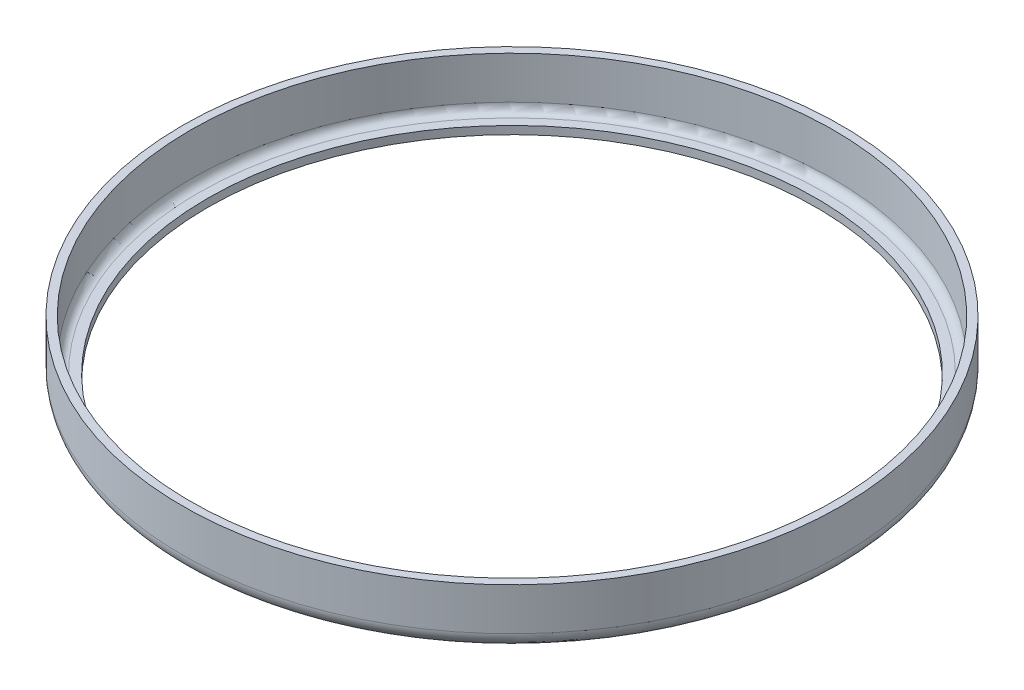
ISO-10303-21;
HEADER;
FILE_DESCRIPTION(('STEP AP214'),'2;1');
FILE_NAME('part.step','',(''),(''),'','','');
FILE_SCHEMA(('AUTOMOTIVE_DESIGN { 1 0 10303 214 1 1 1 1 }'));
ENDSEC;
DATA;
#1=APPLICATION_CONTEXT('core data for automotive mechanical design processes');
#2=APPLICATION_PROTOCOL_DEFINITION('international standard','automotive_design',2000,#1);
#3=PRODUCT_CONTEXT('',#1,'mechanical');
#4=PRODUCT('Part','Part','',(#3));
#5=PRODUCT_RELATED_PRODUCT_CATEGORY('part','',(#4));
#6=PRODUCT_DEFINITION_FORMATION('','',#4);
#7=PRODUCT_DEFINITION_CONTEXT('part definition',#1,'design');
#8=PRODUCT_DEFINITION('design','',#6,#7);
#9=PRODUCT_DEFINITION_SHAPE('','',#8);
#10=(LENGTH_UNIT() NAMED_UNIT(*) SI_UNIT(.MILLI.,.METRE.));
#11=(NAMED_UNIT(*) PLANE_ANGLE_UNIT() SI_UNIT($,.RADIAN.));
#12=(NAMED_UNIT(*) SI_UNIT($,.STERADIAN.) SOLID_ANGLE_UNIT());
#13=UNCERTAINTY_MEASURE_WITH_UNIT(LENGTH_MEASURE(1.E-05),#10,'distance_accuracy_value','');
#14=(GEOMETRIC_REPRESENTATION_CONTEXT(3) GLOBAL_UNCERTAINTY_ASSIGNED_CONTEXT((#13)) GLOBAL_UNIT_ASSIGNED_CONTEXT((#10,
#11,#12)) REPRESENTATION_CONTEXT('',''));
#15=CARTESIAN_POINT('',(0.,0.,0.));
#16=DIRECTION('',(0.,0.,1.));
#17=DIRECTION('',(1.,0.,0.));
#18=AXIS2_PLACEMENT_3D('',#15,#16,#17);
#19=CARTESIAN_POINT('',(0.,1.3,0.));
#20=DIRECTION('',(0.,1.,0.));
#21=DIRECTION('',(-1.,0.,0.));
#22=AXIS2_PLACEMENT_3D('',#19,#20,#21);
#23=PLANE('',#22);
#24=CARTESIAN_POINT('',(0.,1.3,0.));
#25=DIRECTION('',(0.,1.,0.));
#26=DIRECTION('',(-1.,0.,0.));
#27=AXIS2_PLACEMENT_3D('',#24,#25,#26);
#28=CIRCLE('',#27,49.5);
#29=CARTESIAN_POINT('',(-49.5,1.3,0.));
#30=VERTEX_POINT('',#29);
#31=EDGE_CURVE('E53',#30,#30,#28,.F.);
#32=ORIENTED_EDGE('',*,*,#31,.T.);
#33=EDGE_LOOP('',(#32));
#34=FACE_BOUND('',#33,.T.);
#35=CARTESIAN_POINT('',(0.,1.3,0.));
#36=DIRECTION('',(0.,-1.,0.));
#37=DIRECTION('',(-1.,0.,0.));
#38=AXIS2_PLACEMENT_3D('',#35,#36,#37);
#39=CIRCLE('',#38,51.);
#40=CARTESIAN_POINT('',(51.,1.3,0.));
#41=VERTEX_POINT('',#40);
#42=CARTESIAN_POINT('',(-51.,1.3,0.));
#43=VERTEX_POINT('',#42);
#44=EDGE_CURVE('E51',#41,#43,#39,.F.);
#45=ORIENTED_EDGE('',*,*,#44,.T.);
#46=CARTESIAN_POINT('',(51.,1.3,0.));
#47=CARTESIAN_POINT('',(51.0000046991649,1.30000000000006,0.369669613069277));
#48=CARTESIAN_POINT('',(50.9959886631522,1.30000000001861,0.73933924543896));
#49=CARTESIAN_POINT('',(50.9799185109079,1.30000000008694,1.47857318290872));
#50=CARTESIAN_POINT('',(50.9678628860296,1.30000000013672,1.8481374552137));
#51=CARTESIAN_POINT('',(50.9357139316199,1.30000000026173,2.58698571619281));
#52=CARTESIAN_POINT('',(50.9156190941834,1.30000000033696,2.95626963925558));
#53=CARTESIAN_POINT('',(50.8673969180821,1.30000000050757,3.69438223628577));
#54=CARTESIAN_POINT('',(50.8392680731591,1.30000000060295,4.06321081184692));
#55=CARTESIAN_POINT('',(50.7749866245678,1.30000000080883,4.80023779418225));
#56=CARTESIAN_POINT('',(50.7388325169507,1.30000000091934,5.16843606978686));
#57=CARTESIAN_POINT('',(50.6585131714717,1.30000000115084,5.90402766893088));
#58=CARTESIAN_POINT('',(50.6143464326976,1.30000000127183,6.27142082858597));
#59=CARTESIAN_POINT('',(50.5180182456613,1.30000000152,7.00522763012759));
#60=CARTESIAN_POINT('',(50.4658553002325,1.30000000164716,7.3716410754788));
#61=CARTESIAN_POINT('',(50.353554934961,1.30000000190371,8.10331418404306));
#62=CARTESIAN_POINT('',(50.2934160224096,1.30000000203309,8.46857361814922));
#63=CARTESIAN_POINT('',(50.1651877609984,1.30000000229044,9.1977648242569));
#64=CARTESIAN_POINT('',(50.0970969245973,1.30000000241842,9.56169633467483));
#65=CARTESIAN_POINT('',(49.9529926519688,1.30000000266968,10.2880582810532));
#66=CARTESIAN_POINT('',(49.8769777340754,1.30000000279297,10.6504884230637));
#67=CARTESIAN_POINT('',(49.7170569245804,1.30000000303194,11.3736747709662));
#68=CARTESIAN_POINT('',(49.6331495578937,1.30000000314762,11.7344306506679));
#69=CARTESIAN_POINT('',(49.4574792566138,1.30000000336878,12.4540962459532));
#70=CARTESIAN_POINT('',(49.3657148542195,1.30000000347426,12.8130056032471));
#71=CARTESIAN_POINT('',(49.1743696550748,1.30000000367279,13.5288066421813));
#72=CARTESIAN_POINT('',(49.0747873985076,1.30000000376584,13.8856979335895));
#73=CARTESIAN_POINT('',(48.867849418609,1.3000000039376,14.5972921282828));
#74=CARTESIAN_POINT('',(48.760492244142,1.30000000401631,14.9519946095652));
#75=CARTESIAN_POINT('',(48.5380510945432,1.30000000415785,15.6590413529632));
#76=CARTESIAN_POINT('',(48.4229656776505,1.30000000422068,16.0113851614927));
#77=CARTESIAN_POINT('',(48.1851184304675,1.30000000432925,16.7135456918437));
#78=CARTESIAN_POINT('',(48.0623551684801,1.30000000437499,17.0633619286981));
#79=CARTESIAN_POINT('',(47.8092063203949,1.30000000444852,17.7602994934162));
#80=CARTESIAN_POINT('',(47.6788193133494,1.30000000447631,18.1074203051492));
#81=CARTESIAN_POINT('',(47.4104807455075,1.30000000451342,18.7988003239934));
#82=CARTESIAN_POINT('',(47.2725277751935,1.30000000452274,19.1430589840428));
#83=CARTESIAN_POINT('',(46.9891187095064,1.30000000452274,19.8285492115329));
#84=CARTESIAN_POINT('',(46.8436612167211,1.30000000451341,20.1697802012282));
#85=CARTESIAN_POINT('',(46.5453081685863,1.3000000044763,20.8490508882182));
#86=CARTESIAN_POINT('',(46.3924112286009,1.30000000444851,21.187089977346));
#87=CARTESIAN_POINT('',(46.0792479560574,1.30000000437498,21.8598140316753));
#88=CARTESIAN_POINT('',(45.9189802523047,1.30000000432924,22.1944983585653));
#89=CARTESIAN_POINT('',(45.5911477016385,1.30000000422067,22.8603515047095));
#90=CARTESIAN_POINT('',(45.4235814976305,1.30000000415784,23.1915196557992));
#91=CARTESIAN_POINT('',(45.0812277454499,1.3000000040163,23.8501805934415));
#92=CARTESIAN_POINT('',(44.9064388549357,1.30000000393758,24.1776726822827));
#93=CARTESIAN_POINT('',(44.5497190467366,1.30000000376582,24.828823243728));
#94=CARTESIAN_POINT('',(44.3677868021096,1.30000000367277,25.1524809893939));
#95=CARTESIAN_POINT('',(43.9968630873555,1.30000000347425,25.7958062957482));
#96=CARTESIAN_POINT('',(43.8078703063253,1.30000000336876,26.1154731006063));
#97=CARTESIAN_POINT('',(43.4229117700559,1.3000000031476,26.7506617166371));
#98=CARTESIAN_POINT('',(43.2269447205849,1.30000000303192,27.0661827434362));
#99=CARTESIAN_POINT('',(42.8281273116155,1.30000000279295,27.6929268310696));
#100=CARTESIAN_POINT('',(42.6252756751816,1.30000000266966,28.0041490793495));
#101=CARTESIAN_POINT('',(42.2127821307869,1.3000000024184,28.6221445495997));
#102=CARTESIAN_POINT('',(42.0031389638039,1.30000000229042,28.9289169312107));
#103=CARTESIAN_POINT('',(41.5771587314137,1.30000000203307,29.5378635949447));
#104=CARTESIAN_POINT('',(41.3608204255066,1.30000000190369,29.8400370092937));
#105=CARTESIAN_POINT('',(40.9215495795829,1.30000000164715,30.4396387249667));
#106=CARTESIAN_POINT('',(40.6986158181891,1.30000000151999,30.737066131505));
#107=CARTESIAN_POINT('',(40.2462569792677,1.3000000012718,31.3270309564745));
#108=CARTESIAN_POINT('',(40.0168307000787,1.30000000115078,31.6195674535257));
#109=CARTESIAN_POINT('',(39.5515929300617,1.30000000091936,32.1996077739158));
#110=CARTESIAN_POINT('',(39.3157802578678,1.30000000080898,32.487110649707));
#111=CARTESIAN_POINT('',(38.8378790284693,1.30000000060276,33.0569433819124));
#112=CARTESIAN_POINT('',(38.5957893107801,1.30000000050693,33.3392722650653));
#113=CARTESIAN_POINT('',(38.1054461835485,1.30000000033758,33.8986187810305));
#114=CARTESIAN_POINT('',(37.8571916349218,1.30000000026407,34.1756354152794));
#115=CARTESIAN_POINT('',(37.3546350028205,1.30000000013435,34.724222489823));
#116=CARTESIAN_POINT('',(37.1003318023848,1.30000000007814,34.995791906882));
#117=CARTESIAN_POINT('',(36.5857936535088,1.30000000002741,35.5333488401605));
#118=CARTESIAN_POINT('',(36.3255576101463,1.30000000003291,35.7993353083475));
#119=CARTESIAN_POINT('',(35.8001723800571,1.29999999996719,36.3247180675916));
#120=CARTESIAN_POINT('',(35.5350414890215,1.29999999989623,36.5841326556767));
#121=CARTESIAN_POINT('',(34.999202134997,1.30000000041142,37.0971311492343));
#122=CARTESIAN_POINT('',(34.7284937249249,1.30000000099758,37.3507151099769));
#123=CARTESIAN_POINT('',(34.1816260655737,1.30000000732464,37.8519299775034));
#124=CARTESIAN_POINT('',(33.9054668611447,1.3000000130655,38.0995609332326));
#125=CARTESIAN_POINT('',(33.3478240512022,1.3000000358013,38.5887543188629));
#126=CARTESIAN_POINT('',(33.0663404827939,1.30000005279615,38.8303167910276));
#127=CARTESIAN_POINT('',(32.6402322423029,1.30000009786132,39.1880240962407));
#128=CARTESIAN_POINT('',(32.497548265127,1.30000011614533,39.3064877323368));
#129=CARTESIAN_POINT('',(32.2108972791149,1.30000015537928,39.5418443920168));
#130=CARTESIAN_POINT('',(32.066930305559,1.30000017632914,39.6587374585685));
#131=CARTESIAN_POINT('',(31.6331208960968,1.30000022814497,40.0070261744013));
#132=CARTESIAN_POINT('',(31.3413599826186,1.30000024797943,40.2360397272483));
#133=CARTESIAN_POINT('',(30.7528830599669,1.30000024947211,40.6875852799893));
#134=CARTESIAN_POINT('',(30.4561671981806,1.30000023113146,40.9101174721361));
#135=CARTESIAN_POINT('',(29.8579437420357,1.3000001648568,41.3486252690323));
#136=CARTESIAN_POINT('',(29.5564363072011,1.30000011692377,41.5646010913666));
#137=CARTESIAN_POINT('',(28.9486913650392,1.30000003845104,41.989772849017));
#138=CARTESIAN_POINT('',(28.6424540319666,1.30000000791071,42.1989690332269));
#139=CARTESIAN_POINT('',(28.17096063733,1.29999999581543,42.51390918958));
#140=CARTESIAN_POINT('',(28.0072420375427,1.29999999796297,42.6219685498628));
#141=CARTESIAN_POINT('',(27.3072593255819,1.30000000721166,43.0782161180778));
#142=CARTESIAN_POINT('',(26.7650126218891,1.30000001454234,43.4173329309715));
#143=CARTESIAN_POINT('',(25.9498446405497,1.30000005295707,43.9060451771899));
#144=CARTESIAN_POINT('',(25.6816099367491,1.30000006991033,44.0635383536363));
#145=CARTESIAN_POINT('',(25.0971873672794,1.30000010379586,44.3995066156738));
#146=CARTESIAN_POINT('',(24.7804820402069,1.30000012025047,44.5770858226825));
#147=CARTESIAN_POINT('',(24.3220575996272,1.30000013266526,44.8277016796038));
#148=CARTESIAN_POINT('',(24.1818407614096,1.30000013494416,44.9035010437336));
#149=CARTESIAN_POINT('',(23.877730330417,1.3000001367148,45.0660536223251));
#150=CARTESIAN_POINT('',(23.7137116141983,1.30000013569029,45.1525729297063));
#151=CARTESIAN_POINT('',(23.2202553262293,1.30000012955219,45.4094320295097));
#152=CARTESIAN_POINT('',(22.8894101306796,1.30000012137412,45.5770771058449));
#153=CARTESIAN_POINT('',(22.2241370198981,1.30000009809427,45.9050839696395));
#154=CARTESIAN_POINT('',(21.8897091468239,1.30000008299258,46.0654458426844));
#155=CARTESIAN_POINT('',(21.2174373718873,1.30000005106084,46.3788305713557));
#156=CARTESIAN_POINT('',(20.8795935143333,1.30000003423081,46.531853522027));
#157=CARTESIAN_POINT('',(20.2006181924207,1.30000000985872,46.8304187567241));
#158=CARTESIAN_POINT('',(19.859486774664,1.30000000231652,46.9759611466043));
#159=CARTESIAN_POINT('',(19.3190890648286,1.29999999866291,47.1997575258182));
#160=CARTESIAN_POINT('',(19.120823242319,1.29999999906679,47.2804437464646));
#161=CARTESIAN_POINT('',(18.3449455381298,1.30000000391341,47.590537684613));
#162=CARTESIAN_POINT('',(17.7635864912848,1.30000001458042,47.8107026712017));
#163=CARTESIAN_POINT('',(16.8855821651812,1.30000005329979,48.1249668618817));
#164=CARTESIAN_POINT('',(16.5917757907693,1.30000007000635,48.2271033720074));
#165=CARTESIAN_POINT('',(15.9530382894352,1.30000010368367,48.4426005162531));
#166=CARTESIAN_POINT('',(15.6077745432779,1.30000012023136,48.5549816189407));
#167=CARTESIAN_POINT('',(15.1092657048641,1.30000013267355,48.711347913766));
#168=CARTESIAN_POINT('',(14.9569551787648,1.30000013494653,48.7583359127388));
#169=CARTESIAN_POINT('',(14.6269755176825,1.3000001367119,48.8584361330451));
#170=CARTESIAN_POINT('',(14.4492292997733,1.30000013568925,48.911294535104));
#171=CARTESIAN_POINT('',(13.915143918283,1.30000012955415,49.0669496181624));
#172=CARTESIAN_POINT('',(13.5579498851758,1.30000012137463,49.1668287432459));
#173=CARTESIAN_POINT('',(12.8414688435845,1.30000009809374,49.3587446999893));
#174=CARTESIAN_POINT('',(12.482181859751,1.30000008299244,49.4507816238146));
#175=CARTESIAN_POINT('',(11.7616892714803,1.30000005106099,49.6269910362352));
#176=CARTESIAN_POINT('',(11.400483691958,1.30000003423086,49.7111636266934));
#177=CARTESIAN_POINT('',(10.6763075025147,1.30000000985868,49.8715304997934));
#178=CARTESIAN_POINT('',(10.3133369176493,1.30000000231651,49.9477248953471));
#179=CARTESIAN_POINT('',(9.7396623346749,1.29999999866292,50.0617947179567));
#180=CARTESIAN_POINT('',(9.52946507773591,1.2999999990668,50.1022508241467));
#181=CARTESIAN_POINT('',(8.70799932042349,1.30000000391341,50.2550201652447));
#182=CARTESIAN_POINT('',(8.09485882254318,1.30000001458043,50.3575372278738));
#183=CARTESIAN_POINT('',(7.17241510854469,1.30000005329983,50.4944727872836));
#184=CARTESIAN_POINT('',(6.86432824804019,1.30000007000639,50.5373279991074));
#185=CARTESIAN_POINT('',(6.19582246358128,1.30000010368371,50.6240729243048));
#186=CARTESIAN_POINT('',(5.83526840885767,1.30000012023137,50.6669370379968));
#187=CARTESIAN_POINT('',(5.31583277546438,1.30000013267361,50.7230445420601));
#188=CARTESIAN_POINT('',(5.15728198726677,1.30000013494661,50.7394153661291));
#189=CARTESIAN_POINT('',(4.81411424703339,1.30000013671189,50.7732163467039));
#190=CARTESIAN_POINT('',(4.62947121099013,1.30000013568911,50.7903825225141));
#191=CARTESIAN_POINT('',(4.07528132661085,1.30000012955451,50.8388518476437));
#192=CARTESIAN_POINT('',(3.70546521586692,1.30000012137653,50.8671267241572));
#193=CARTESIAN_POINT('',(2.96531023536046,1.30000009809184,50.9155765530608));
#194=CARTESIAN_POINT('',(2.5949713717936,1.30000008298521,50.9357516006544));
#195=CARTESIAN_POINT('',(1.85394600121345,1.30000005106821,50.9680140653138));
#196=CARTESIAN_POINT('',(1.48325949876579,1.30000003425788,50.9801015871457));
#197=CARTESIAN_POINT('',(0.74171247899899,1.30000000983165,50.9961072981522));
#198=CARTESIAN_POINT('',(0.370851964217216,1.30000000221563,51.0000256029571));
#199=CARTESIAN_POINT('',(-0.214054524708752,1.29999999872115,50.999985222058));
#200=CARTESIAN_POINT('',(-0.428106200745506,1.29999999924147,50.9986565075256));
#201=CARTESIAN_POINT('',(-1.10785172307652,1.30000000262994,50.9901739443362));
#202=CARTESIAN_POINT('',(-1.57350073550029,1.30000000753931,50.9780078792497));
#203=CARTESIAN_POINT('',(-2.1945148666214,1.30000002747557,50.9532710409311));
#204=CARTESIAN_POINT('',(-2.35012670464694,1.30000003359408,50.9463586801112));
#205=CARTESIAN_POINT('',(-2.81637417279211,1.30000005394559,50.9235047907943));
#206=CARTESIAN_POINT('',(-3.12690877924904,1.30000007018736,50.9054315240626));
#207=CARTESIAN_POINT('',(-3.79949834137681,1.30000010347241,50.860090439503));
#208=CARTESIAN_POINT('',(-4.1614842155736,1.30000012019547,50.8317904240088));
#209=CARTESIAN_POINT('',(-4.68188430883593,1.30000013268934,50.7854830019371));
#210=CARTESIAN_POINT('',(-4.84058254895228,1.30000013495121,50.7706075340869));
#211=CARTESIAN_POINT('',(-5.18375081542277,1.30000013670654,50.7368103271883));
#212=CARTESIAN_POINT('',(-5.36819489011766,1.30000013568726,50.7176245923849));
#213=CARTESIAN_POINT('',(-5.92119198396609,1.3000001295583,50.6570455132628));
#214=CARTESIAN_POINT('',(-6.28941837731449,1.30000012137759,50.6126295502994));
#215=CARTESIAN_POINT('',(-7.02480360988048,1.30000009809091,50.5157513547438));
#216=CARTESIAN_POINT('',(-7.39196246159535,1.300000082985,50.4632892167345));
#217=CARTESIAN_POINT('',(-8.12504332401157,1.30000005106853,50.3503648893269));
#218=CARTESIAN_POINT('',(-8.49096535067372,1.30000003425799,50.2899028035726));
#219=CARTESIAN_POINT('',(-9.22138631369826,1.30000000983159,50.1609323223365));
#220=CARTESIAN_POINT('',(-9.58588527013047,1.30000000221562,50.0924240407582));
#221=CARTESIAN_POINT('',(-10.1595450697226,1.29999999872116,49.9782748398467));
#222=CARTESIAN_POINT('',(-10.3692245867145,1.29999999924147,49.9352122451056));
#223=CARTESIAN_POINT('',(-11.0342541247267,1.30000000262994,49.7942808987537));
#224=CARTESIAN_POINT('',(-11.4885823383103,1.30000000753931,49.6915049858091));
#225=CARTESIAN_POINT('',(-12.0928379359815,1.30000002747556,49.5460896128307));
#226=CARTESIAN_POINT('',(-12.2441112001844,1.30000003359408,49.5089517078082));
#227=CARTESIAN_POINT('',(-12.6969413361502,1.30000005394558,49.3955765671486));
#228=CARTESIAN_POINT('',(-12.9979832436318,1.30000007018736,49.3172682617287));
#229=CARTESIAN_POINT('',(-13.6488036219295,1.30000010347242,49.1415826652077));
#230=CARTESIAN_POINT('',(-13.9983129672219,1.30000012019547,49.0432064882481));
#231=CARTESIAN_POINT('',(-14.4996795327833,1.30000013268932,48.8962638434598));
#232=CARTESIAN_POINT('',(-14.6524263277089,1.30000013495118,48.8507137254328));
#233=CARTESIAN_POINT('',(-14.9824071611332,1.30000013670649,48.7506171278049));
#234=CARTESIAN_POINT('',(-15.1595642434866,1.3000001356872,48.6958167875645));
#235=CARTESIAN_POINT('',(-15.6901172612386,1.30000012955822,48.5285173372811));
#236=CARTESIAN_POINT('',(-16.0426031632133,1.30000012137751,48.4131174089068));
#237=CARTESIAN_POINT('',(-16.7449581764628,1.30000009809082,48.1746341588412));
#238=CARTESIAN_POINT('',(-17.094827318447,1.30000008298492,48.0515509274772));
#239=CARTESIAN_POINT('',(-17.791791794361,1.30000005106847,47.7977794278237));
#240=CARTESIAN_POINT('',(-18.1388871641648,1.30000003425795,47.6670912580727));
#241=CARTESIAN_POINT('',(-18.8301124006247,1.30000000983158,47.3981008476258));
#242=CARTESIAN_POINT('',(-19.1742423091864,1.30000000221561,47.2597987147293));
#243=CARTESIAN_POINT('',(-19.7146100367862,1.29999999872116,47.0359273652313));
#244=CARTESIAN_POINT('',(-19.9118595694468,1.29999999924147,46.9527857426874));
#245=CARTESIAN_POINT('',(-20.5366164265992,1.30000000262994,46.6848215165471));
#246=CARTESIAN_POINT('',(-20.9621642382518,1.30000000753931,46.4953853874041));
#247=CARTESIAN_POINT('',(-21.5264400581376,1.30000002747558,46.2348797304953));
#248=CARTESIAN_POINT('',(-21.6675613856586,1.3000000335941,46.1689434781616));
#249=CARTESIAN_POINT('',(-22.089572012848,1.30000005394561,45.9694040849859));
#250=CARTESIAN_POINT('',(-22.3695521981961,1.3000000701874,45.8338701355051));
#251=CARTESIAN_POINT('',(-22.9735926147478,1.30000010347246,45.5345915711503));
#252=CARTESIAN_POINT('',(-23.2971940175678,1.30000012019552,45.3699197653397));
#253=CARTESIAN_POINT('',(-23.7602599711893,1.30000013268938,45.1279887713056));
#254=CARTESIAN_POINT('',(-23.9011854642319,1.30000013495124,45.0535144269238));
#255=CARTESIAN_POINT('',(-24.2052980027924,1.30000013670656,44.8909650519386));
#256=CARTESIAN_POINT('',(-24.368360045463,1.30000013568727,44.8026560526325));
#257=CARTESIAN_POINT('',(-24.8560801321243,1.3000001295583,44.5350654553101));
#258=CARTESIAN_POINT('',(-25.1792797071429,1.30000012137759,44.3531163160811));
#259=CARTESIAN_POINT('',(-25.821613391695,1.30000009809089,43.9821927890866));
#260=CARTESIAN_POINT('',(-26.1407475489698,1.30000008298498,43.7932184839218));
#261=CARTESIAN_POINT('',(-26.7748116843009,1.30000005106851,43.4083521084226));
#262=CARTESIAN_POINT('',(-27.0897417167658,1.30000003425797,43.2124601277346));
#263=CARTESIAN_POINT('',(-27.7152078282851,1.30000000983159,42.8137869385895));
#264=CARTESIAN_POINT('',(-28.0257439694706,1.30000000221562,42.6110058276851));
#265=CARTESIAN_POINT('',(-28.5120535245396,1.29999999872116,42.2860156057633));
#266=CARTESIAN_POINT('',(-28.6892928125465,1.29999999924147,42.1659900680065));
#267=CARTESIAN_POINT('',(-29.2497679057283,1.30000000262994,41.7812906904656));
#268=CARTESIAN_POINT('',(-29.630181794887,1.30000000753931,41.5124742539978));
#269=CARTESIAN_POINT('',(-30.132793104771,1.30000002747556,41.1468893717482));
#270=CARTESIAN_POINT('',(-30.2583393104036,1.30000003359408,41.0546886538253));
#271=CARTESIAN_POINT('',(-30.6333129054674,1.30000005394558,40.7766531736862));
#272=CARTESIAN_POINT('',(-30.8814719672289,1.30000007018735,40.5891020626621));
#273=CARTESIAN_POINT('',(-31.4155195493921,1.3000001034724,40.1777316259876));
#274=CARTESIAN_POINT('',(-31.70077717132,1.30000012019545,39.9530924376071));
#275=CARTESIAN_POINT('',(-32.1077470680216,1.30000013268932,39.6254703776684));
#276=CARTESIAN_POINT('',(-32.2314355094642,1.3000001349512,39.5249338242001));
#277=CARTESIAN_POINT('',(-32.497992816897,1.30000013670653,39.3061783637624));
#278=CARTESIAN_POINT('',(-32.6406934370288,1.30000013568725,39.1877543707299));
#279=CARTESIAN_POINT('',(-33.0668377831757,1.3000001295583,38.8301559830172));
#280=CARTESIAN_POINT('',(-33.348330652812,1.3000001213776,38.5886498363556));
#281=CARTESIAN_POINT('',(-33.9059584853701,1.30000009809092,38.0995404156386));
#282=CARTESIAN_POINT('',(-34.1820935112305,1.30000008298501,37.851937213283));
#283=CARTESIAN_POINT('',(-34.7288905768129,1.30000005106854,37.3507661609891));
#284=CARTESIAN_POINT('',(-34.9995526873872,1.300000034258,37.0971983883602));
#285=CARTESIAN_POINT('',(-35.5352233620278,1.3000000098316,36.5841632076862));
#286=CARTESIAN_POINT('',(-35.8002320060629,1.30000000221562,36.3246958831983));
#287=CARTESIAN_POINT('',(-36.2137948239024,1.29999999872116,35.9110759579632));
#288=CARTESIAN_POINT('',(-36.364212699335,1.29999999924147,35.7587789957293));
#289=CARTESIAN_POINT('',(-36.838867299342,1.30000000262994,35.272128237368));
#290=CARTESIAN_POINT('',(-37.1595281500539,1.30000000753931,34.9342619722467));
#291=CARTESIAN_POINT('',(-37.5811598407395,1.30000002747557,34.4776471107462));
#292=CARTESIAN_POINT('',(-37.6863062390014,1.30000003359409,34.3627251589457));
#293=CARTESIAN_POINT('',(-37.9998328308574,1.3000000539456,34.0168782883994));
#294=CARTESIAN_POINT('',(-38.2066342233475,1.30000007018739,33.7845174375911));
#295=CARTESIAN_POINT('',(-38.6501658723311,1.30000010347244,33.2768638127171));
#296=CARTESIAN_POINT('',(-38.8861174067675,1.3000001201955,33.0008900125641));
#297=CARTESIAN_POINT('',(-39.2213515534991,1.30000013268935,32.6001672808883));
#298=CARTESIAN_POINT('',(-39.323049614118,1.30000013495121,32.4774321312673));
#299=CARTESIAN_POINT('',(-39.5418079912706,1.30000013670652,32.2108772850321));
#300=CARTESIAN_POINT('',(-39.6586632840557,1.30000013568723,32.0668892658518));
#301=CARTESIAN_POINT('',(-40.0068554014556,1.30000012955825,31.6330253930763));
#302=CARTESIAN_POINT('',(-40.2358239526147,1.30000012137754,31.3412431846681));
#303=CARTESIAN_POINT('',(-40.6873166083685,1.30000009809084,30.7527440708092));
#304=CARTESIAN_POINT('',(-40.9098407886804,1.30000008298494,30.4560272234018));
#305=CARTESIAN_POINT('',(-41.3483576800548,1.30000005106849,29.8578112166672));
#306=CARTESIAN_POINT('',(-41.5643504756906,1.30000003425795,29.5563121193414));
#307=CARTESIAN_POINT('',(-41.9896401900517,1.30000000983158,28.9486306013573));
#308=CARTESIAN_POINT('',(-42.1989372035104,1.30000000221562,28.6424482470495));
#309=CARTESIAN_POINT('',(-42.5238603118628,1.29999999872116,28.1560937667486));
#310=CARTESIAN_POINT('',(-42.6416763145116,1.29999999924147,27.9773780332246));
#311=CARTESIAN_POINT('',(-43.0122697158312,1.30000000262994,27.4074775955576));
#312=CARTESIAN_POINT('',(-43.2608547025972,1.30000000753931,27.0135455327547));
#313=CARTESIAN_POINT('',(-43.5853036909416,1.30000002747558,26.4834481786499));
#314=CARTESIAN_POINT('',(-43.6660095593955,1.30000003359409,26.3502213926736));
#315=CARTESIAN_POINT('',(-43.906040368536,1.30000005394561,25.9498540021881));
#316=CARTESIAN_POINT('',(-44.0635367098416,1.30000007018739,25.6816130666414));
#317=CARTESIAN_POINT('',(-44.3995076657973,1.30000010347245,25.0971852251658));
#318=CARTESIAN_POINT('',(-44.577085657018,1.3000001201955,24.7804822984465));
#319=CARTESIAN_POINT('',(-44.827701314415,1.30000013268937,24.3220582872573));
#320=CARTESIAN_POINT('',(-44.9035008857807,1.30000013495124,24.1818410596848));
#321=CARTESIAN_POINT('',(-45.066053660732,1.30000013670657,23.8777302553551));
#322=CARTESIAN_POINT('',(-45.1525729428119,1.30000013568729,23.7137115889185));
#323=CARTESIAN_POINT('',(-45.4094320036708,1.30000012955833,23.220255376578));
#324=CARTESIAN_POINT('',(-45.5770771033214,1.30000012137762,22.8894101331601));
#325=CARTESIAN_POINT('',(-45.9050839726277,1.30000009809092,22.2241370172466));
#326=CARTESIAN_POINT('',(-46.0654458278694,1.30000008298501,21.8897091869074));
#327=CARTESIAN_POINT('',(-46.3788305867041,1.30000005106854,21.2174373315525));
#328=CARTESIAN_POINT('',(-46.5318535853412,1.300000034258,20.8795933508474));
#329=CARTESIAN_POINT('',(-46.8304186938619,1.30000000983159,20.2006183555335));
#330=CARTESIAN_POINT('',(-46.975960909603,1.3000000022156,19.8594873875187));
#331=CARTESIAN_POINT('',(-47.1997571463251,1.29999999872117,19.3190899577673));
#332=CARTESIAN_POINT('',(-47.2804431397036,1.2999999992415,19.1208246806685));
#333=CARTESIAN_POINT('',(-47.5327334697675,1.30000000262987,18.4895760835261));
#334=CARTESIAN_POINT('',(-47.6996899314746,1.30000000753901,18.0547160784695));
#335=CARTESIAN_POINT('',(-47.9144883238679,1.30000002747437,17.4715063312661));
#336=CARTESIAN_POINT('',(-47.9676523755061,1.30000003359262,17.3250940361779));
#337=CARTESIAN_POINT('',(-48.1249631703835,1.30000005394312,16.8855921438769));
#338=CARTESIAN_POINT('',(-48.2271018041709,1.300000070184,16.5917801066629));
#339=CARTESIAN_POINT('',(-48.4426007887539,1.300000103467,15.9530377900092));
#340=CARTESIAN_POINT('',(-48.5549810570052,1.30000012018886,15.6077763217853));
#341=CARTESIAN_POINT('',(-48.711347361751,1.30000013268137,15.1092673895604));
#342=CARTESIAN_POINT('',(-48.758335619965,1.30000013494287,14.9569560647349));
#343=CARTESIAN_POINT('',(-48.8584360892799,1.30000013669757,14.6269756138907));
#344=CARTESIAN_POINT('',(-48.9112944751635,1.30000013567807,14.4492294391988));
#345=CARTESIAN_POINT('',(-49.0669495361497,1.30000012954879,13.9151441135289));
#346=CARTESIAN_POINT('',(-49.1668286817137,1.30000012136834,13.5579500194346));
#347=CARTESIAN_POINT('',(-49.3587446544049,1.30000009808295,12.8414689483657));
#348=CARTESIAN_POINT('',(-49.4507815736902,1.30000008297809,12.4821819960384));
#349=CARTESIAN_POINT('',(-49.6269910108548,1.30000005106407,11.7616892961059));
#350=CARTESIAN_POINT('',(-49.7111636305884,1.30000003425493,11.4004835734157));
#351=CARTESIAN_POINT('',(-49.8715304561316,1.3000000098307,10.6763077022004));
#352=CARTESIAN_POINT('',(-49.947724774846,1.30000000221549,10.3133375787202));
#353=CARTESIAN_POINT('',(-50.0617952903568,1.29999999872121,9.73965942380623));
#354=CARTESIAN_POINT('',(-50.1022520036492,1.29999999924142,9.52945887600975));
#355=CARTESIAN_POINT('',(-50.2265443350908,1.30000000263083,8.86111840086266));
#356=CARTESIAN_POINT('',(-50.3054553714565,1.30000000754277,8.40204462587745));
#357=CARTESIAN_POINT('',(-50.4023472877308,1.30000002748612,7.78813957977577));
#358=CARTESIAN_POINT('',(-50.42592595731,1.3000000336067,7.63417022677158));
#359=CARTESIAN_POINT('',(-50.4944717715287,1.30000005396535,7.17242166904866));
#360=CARTESIAN_POINT('',(-50.5373283765944,1.30000007021303,6.86432565742804));
#361=CARTESIAN_POINT('',(-50.6240743879206,1.30000010351058,6.19581225586039));
#362=CARTESIAN_POINT('',(-50.6669380082089,1.30000012024021,5.83526125542635));
#363=CARTESIAN_POINT('',(-50.7230450670755,1.30000013274214,5.31582862237422));
#364=CARTESIAN_POINT('',(-50.7394157109703,1.30000013500629,5.1572794393338));
#365=CARTESIAN_POINT('',(-50.7732165905902,1.30000013676321,4.81411335675066));
#366=CARTESIAN_POINT('',(-50.7903828378539,1.30000013574266,4.62947040646187));
#367=CARTESIAN_POINT('',(-50.83885180343,1.30000012962288,4.07528067201335));
#368=CARTESIAN_POINT('',(-50.8671256752141,1.30000012146562,3.70546451664118));
#369=CARTESIAN_POINT('',(-50.9155779327707,1.30000009810747,2.96530978391376));
#370=CARTESIAN_POINT('',(-50.9357564137404,1.30000008290667,2.59497121275322));
#371=CARTESIAN_POINT('',(-50.9680094973711,1.30000005121444,1.85394537907797));
#372=CARTESIAN_POINT('',(-50.9800842050579,1.30000003472303,1.48325812114463));
#373=CARTESIAN_POINT('',(-50.9961248145328,1.30000000938969,0.741713459113538));
#374=CARTESIAN_POINT('',(-51.0000908311468,1.30000000054764,0.370856057499557));
#375=CARTESIAN_POINT('',(-51.,1.3,0.));
#376=B_SPLINE_CURVE_WITH_KNOTS('',3,(#46,#47,#48,#49,#50,#51,#52,#53,#54,#55,#56,#57,#58,#59,
#60,#61,#62,#63,#64,#65,#66,#67,#68,#69,#70,#71,#72,#73,#74,#75,#76,#77,#78,#79,#80,#81,#82,#83,
#84,#85,#86,#87,#88,#89,#90,#91,#92,#93,#94,#95,#96,#97,#98,#99,#100,#101,#102,#103,#104,#105,
#106,#107,#108,#109,#110,#111,#112,#113,#114,#115,#116,#117,#118,#119,#120,#121,#122,#123,#124,
#125,#126,#127,#128,#129,#130,#131,#132,#133,#134,#135,#136,#137,#138,#139,#140,#141,#142,#143,
#144,#145,#146,#147,#148,#149,#150,#151,#152,#153,#154,#155,#156,#157,#158,#159,#160,#161,#162,
#163,#164,#165,#166,#167,#168,#169,#170,#171,#172,#173,#174,#175,#176,#177,#178,#179,#180,#181,
#182,#183,#184,#185,#186,#187,#188,#189,#190,#191,#192,#193,#194,#195,#196,#197,#198,#199,#200,
#201,#202,#203,#204,#205,#206,#207,#208,#209,#210,#211,#212,#213,#214,#215,#216,#217,#218,#219,
#220,#221,#222,#223,#224,#225,#226,#227,#228,#229,#230,#231,#232,#233,#234,#235,#236,#237,#238,
#239,#240,#241,#242,#243,#244,#245,#246,#247,#248,#249,#250,#251,#252,#253,#254,#255,#256,#257,
#258,#259,#260,#261,#262,#263,#264,#265,#266,#267,#268,#269,#270,#271,#272,#273,#274,#275,#276,
#277,#278,#279,#280,#281,#282,#283,#284,#285,#286,#287,#288,#289,#290,#291,#292,#293,#294,#295,
#296,#297,#298,#299,#300,#301,#302,#303,#304,#305,#306,#307,#308,#309,#310,#311,#312,#313,#314,
#315,#316,#317,#318,#319,#320,#321,#322,#323,#324,#325,#326,#327,#328,#329,#330,#331,#332,#333,
#334,#335,#336,#337,#338,#339,#340,#341,#342,#343,#344,#345,#346,#347,#348,#349,#350,#351,#352,
#353,#354,#355,#356,#357,#358,#359,#360,#361,#362,#363,#364,#365,#366,#367,#368,#369,#370,#371,
#372,#373,#374,#375),.UNSPECIFIED.,.F.,.F.,(4,2,2,2,2,2,2,2,2,2,2,2,2,2,2,2,2,2,2,2,2,2,2,2,2,2,
2,2,2,2,2,2,2,2,2,2,2,2,2,2,2,2,2,2,2,2,2,2,2,2,2,2,2,2,2,2,2,2,2,2,2,2,2,2,2,2,2,2,2,2,2,2,2,2,
2,2,2,2,2,2,2,2,2,2,2,2,2,2,2,2,2,2,2,2,2,2,2,2,2,2,2,2,2,2,2,2,2,2,2,2,2,2,2,2,2,2,2,2,2,2,2,2,
2,2,2,2,2,2,2,2,2,2,2,2,2,2,2,2,2,2,2,2,2,2,2,2,2,2,2,2,2,2,2,2,2,2,2,2,2,2,2,2,2,2,4),(0.,
1.10898694899244,2.21818206043523,3.32758531985591,4.43719671277391,5.54701622470038,
6.65704384113839,7.76727954758273,8.87772332952007,9.98837517242881,11.0992350617793,
12.2103029830334,13.3215789216453,14.4330628630605,15.5447547927165,16.6566546960428,
17.7687625584604,18.8810783653822,19.993602102213,21.1063337543495,22.2192733071799,
23.3324207460845,24.4457760564353,25.5593392235961,26.6731102329225,27.787089069762,
28.9012757194539,30.0156701673292,31.1302723987108,32.2450823989133,33.3601001532434,
34.4753256469992,35.590758865471,36.7063997939407,37.822248417682,38.9383047219606,
40.0545686920337,41.1672760980835,42.2799729521404,43.3926606545294,44.5053406055312,
45.0616863438236,45.6180168304388,46.7306386827574,47.8432274983616,48.9557793502801,
50.068290311898,50.6567811228606,52.5748785317038,53.5080039116336,54.5971831824757,
55.075358707127,55.6316666089526,56.7442568074586,57.8568339284583,58.9693966368103,
60.0819435974138,60.7241023103459,62.5885401327649,63.5216647878449,64.6108442197974,
65.0890203082729,65.6453282100999,66.757918408609,67.8704955296116,68.9830582379659,
70.0956051985707,70.7377637767725,72.6022017333392,73.5353265351529,74.6245059343863,
75.1026819086273,75.6589898105369,76.7715800092106,77.8841571303774,78.9967198388959,
80.1092667996651,80.7514252183384,82.1486285267094,82.6159216903693,83.5490464703834,
84.6382258745157,85.1164018657638,85.672709767615,86.7852999661657,87.8978770872002,
89.0104397955755,90.1229867561893,90.7651451845401,92.1623484868065,92.629641646474,
93.562766599965,94.6519459654588,95.1301218216932,95.6864297236122,96.7990199223069,
97.9115970434977,99.0241597520431,100.136706712842,100.778865285694,102.176068501344,
102.643361603243,103.576486242828,104.665665678101,105.143841778514,105.700149680433,
106.812739879122,107.925317000297,109.037879708818,110.150426669582,110.792585154096,
112.189788423022,112.657081560369,113.590206120554,114.679385573537,115.15756173577,
115.713869637636,116.826459836215,117.939036957276,119.051599665676,120.164146626313,
120.806305160074,122.203508399088,122.670801516587,123.603926278028,124.6931056862,
125.171281691811,125.727589593738,126.840179792448,127.952756913651,129.065319622207,
130.177866583015,130.820025270468,132.217228417639,132.684521473809,133.617645830763,
134.706825328903,135.185001649205,135.741309551067,136.853899749637,137.966476870688,
139.079039579078,140.191586539703,140.833741203276,142.230946662436,142.698241286646,
143.631363313456,144.7205433046,145.198721414288,145.755029336092,146.867619575298,
147.980196738051,149.09275948929,150.205306493992,150.847472833507,152.244671850849,
152.711962033653,153.645093835118,154.734271790678,155.21244242425,155.768750238174,
156.881340256413,157.99391719085,159.1064797059,160.219026466019),.UNSPECIFIED.);
#377=EDGE_CURVE('E46',#43,#41,#376,.F.);
#378=ORIENTED_EDGE('',*,*,#377,.T.);
#379=EDGE_LOOP('',(#45,#378));
#380=FACE_BOUND('',#379,.T.);
#381=ADVANCED_FACE('F17',(#34,#380),#23,.T.);
#382=CARTESIAN_POINT('',(0.,-0.475,0.));
#383=DIRECTION('',(0.,1.,0.));
#384=DIRECTION('',(-1.,0.,0.));
#385=AXIS2_PLACEMENT_3D('',#382,#383,#384);
#386=CYLINDRICAL_SURFACE('',#385,49.5);
#387=ORIENTED_EDGE('',*,*,#31,.F.);
#388=EDGE_LOOP('',(#387));
#389=FACE_BOUND('',#388,.T.);
#390=CARTESIAN_POINT('',(0.,0.,0.));
#391=DIRECTION('',(0.,1.,0.));
#392=DIRECTION('',(-1.,0.,0.));
#393=AXIS2_PLACEMENT_3D('',#390,#391,#392);
#394=CIRCLE('',#393,49.5);
#395=CARTESIAN_POINT('',(-49.5,0.,0.));
#396=VERTEX_POINT('',#395);
#397=EDGE_CURVE('E56',#396,#396,#394,.F.);
#398=ORIENTED_EDGE('',*,*,#397,.T.);
#399=EDGE_LOOP('',(#398));
#400=FACE_BOUND('',#399,.T.);
#401=ADVANCED_FACE('F89',(#389,#400),#386,.F.);
#402=CARTESIAN_POINT('',(0.,2.6,0.));
#403=DIRECTION('',(0.,1.,0.));
#404=DIRECTION('',(0.,0.,1.));
#405=AXIS2_PLACEMENT_3D('',#402,#403,#404);
#406=TOROIDAL_SURFACE('',#405,51.,1.3);
#407=CARTESIAN_POINT('',(0.,2.6,0.));
#408=DIRECTION('',(0.,1.,0.));
#409=DIRECTION('',(-1.,0.,0.));
#410=AXIS2_PLACEMENT_3D('',#407,#408,#409);
#411=CIRCLE('',#410,52.3);
#412=CARTESIAN_POINT('',(-52.3,2.60000000000001,0.));
#413=VERTEX_POINT('',#412);
#414=EDGE_CURVE('E59',#413,#413,#411,.T.);
#415=ORIENTED_EDGE('',*,*,#414,.T.);
#416=EDGE_LOOP('',(#415));
#417=FACE_BOUND('',#416,.T.);
#418=ORIENTED_EDGE('',*,*,#44,.F.);
#419=ORIENTED_EDGE('',*,*,#377,.F.);
#420=EDGE_LOOP('',(#418,#419));
#421=FACE_BOUND('',#420,.T.);
#422=ADVANCED_FACE('F50',(#417,#421),#406,.F.);
#423=CARTESIAN_POINT('',(0.,0.,0.));
#424=DIRECTION('',(0.,1.,0.));
#425=DIRECTION('',(-1.,0.,0.));
#426=AXIS2_PLACEMENT_3D('',#423,#424,#425);
#427=PLANE('',#426);
#428=ORIENTED_EDGE('',*,*,#397,.F.);
#429=EDGE_LOOP('',(#428));
#430=FACE_BOUND('',#429,.T.);
#431=CARTESIAN_POINT('',(0.,0.,0.));
#432=DIRECTION('',(0.,1.,0.));
#433=DIRECTION('',(1.,0.,0.));
#434=AXIS2_PLACEMENT_3D('',#431,#432,#433);
#435=CIRCLE('',#434,51.);
#436=CARTESIAN_POINT('',(51.,0.,0.));
#437=VERTEX_POINT('',#436);
#438=CARTESIAN_POINT('',(-51.,0.,0.));
#439=VERTEX_POINT('',#438);
#440=EDGE_CURVE('E37',#437,#439,#435,.T.);
#441=ORIENTED_EDGE('',*,*,#440,.F.);
#442=CARTESIAN_POINT('',(0.,0.,0.));
#443=DIRECTION('',(0.,1.,0.));
#444=DIRECTION('',(-1.,0.,0.));
#445=AXIS2_PLACEMENT_3D('',#442,#443,#444);
#446=CIRCLE('',#445,51.);
#447=EDGE_CURVE('E127',#439,#437,#446,.T.);
#448=ORIENTED_EDGE('',*,*,#447,.F.);
#449=EDGE_LOOP('',(#441,#448));
#450=FACE_BOUND('',#449,.T.);
#451=ADVANCED_FACE('F88',(#430,#450),#427,.F.);
#452=CARTESIAN_POINT('',(0.,-0.475,0.));
#453=DIRECTION('',(0.,1.,0.));
#454=DIRECTION('',(-1.,0.,0.));
#455=AXIS2_PLACEMENT_3D('',#452,#453,#454);
#456=CYLINDRICAL_SURFACE('',#455,52.3);
#457=CARTESIAN_POINT('',(0.,9.5,0.));
#458=DIRECTION('',(0.,1.,0.));
#459=DIRECTION('',(-1.,0.,0.));
#460=AXIS2_PLACEMENT_3D('',#457,#458,#459);
#461=CIRCLE('',#460,52.3);
#462=CARTESIAN_POINT('',(-52.3,9.5,0.));
#463=VERTEX_POINT('',#462);
#464=EDGE_CURVE('E136',#463,#463,#461,.F.);
#465=ORIENTED_EDGE('',*,*,#464,.F.);
#466=EDGE_LOOP('',(#465));
#467=FACE_BOUND('',#466,.T.);
#468=ORIENTED_EDGE('',*,*,#414,.F.);
#469=EDGE_LOOP('',(#468));
#470=FACE_BOUND('',#469,.T.);
#471=ADVANCED_FACE('F112',(#467,#470),#456,.F.);
#472=CARTESIAN_POINT('',(0.,2.6,0.));
#473=DIRECTION('',(0.,1.,0.));
#474=DIRECTION('',(0.,0.,-1.));
#475=AXIS2_PLACEMENT_3D('',#472,#473,#474);
#476=TOROIDAL_SURFACE('',#475,51.,2.6);
#477=CARTESIAN_POINT('',(0.,2.6,0.));
#478=DIRECTION('',(0.,1.,0.));
#479=DIRECTION('',(-1.,0.,0.));
#480=AXIS2_PLACEMENT_3D('',#477,#478,#479);
#481=CIRCLE('',#480,53.6);
#482=CARTESIAN_POINT('',(-53.6,2.6,0.));
#483=VERTEX_POINT('',#482);
#484=EDGE_CURVE('E29',#483,#483,#481,.T.);
#485=ORIENTED_EDGE('',*,*,#484,.F.);
#486=EDGE_LOOP('',(#485));
#487=FACE_BOUND('',#486,.T.);
#488=ORIENTED_EDGE('',*,*,#447,.T.);
#489=ORIENTED_EDGE('',*,*,#440,.T.);
#490=EDGE_LOOP('',(#488,#489));
#491=FACE_BOUND('',#490,.T.);
#492=ADVANCED_FACE('F101',(#487,#491),#476,.T.);
#493=CARTESIAN_POINT('',(0.,9.5,0.));
#494=DIRECTION('',(0.,1.,0.));
#495=DIRECTION('',(-1.,0.,0.));
#496=AXIS2_PLACEMENT_3D('',#493,#494,#495);
#497=PLANE('',#496);
#498=ORIENTED_EDGE('',*,*,#464,.T.);
#499=EDGE_LOOP('',(#498));
#500=FACE_BOUND('',#499,.T.);
#501=CARTESIAN_POINT('',(0.,9.5,0.));
#502=DIRECTION('',(0.,1.,0.));
#503=DIRECTION('',(-1.,0.,0.));
#504=AXIS2_PLACEMENT_3D('',#501,#502,#503);
#505=CIRCLE('',#504,53.6);
#506=CARTESIAN_POINT('',(-53.6,9.50000000000001,0.));
#507=VERTEX_POINT('',#506);
#508=EDGE_CURVE('E11',#507,#507,#505,.F.);
#509=ORIENTED_EDGE('',*,*,#508,.F.);
#510=EDGE_LOOP('',(#509));
#511=FACE_BOUND('',#510,.T.);
#512=ADVANCED_FACE('F111',(#500,#511),#497,.T.);
#513=CARTESIAN_POINT('',(0.,-0.475,0.));
#514=DIRECTION('',(0.,1.,0.));
#515=DIRECTION('',(-1.,0.,0.));
#516=AXIS2_PLACEMENT_3D('',#513,#514,#515);
#517=CYLINDRICAL_SURFACE('',#516,53.6);
#518=ORIENTED_EDGE('',*,*,#508,.T.);
#519=EDGE_LOOP('',(#518));
#520=FACE_BOUND('',#519,.T.);
#521=ORIENTED_EDGE('',*,*,#484,.T.);
#522=EDGE_LOOP('',(#521));
#523=FACE_BOUND('',#522,.T.);
#524=ADVANCED_FACE('F155',(#520,#523),#517,.T.);
#525=CLOSED_SHELL('',(#381,#401,#422,#451,#471,#492,#512,#524));
#526=MANIFOLD_SOLID_BREP('B1',#525);
#527=ADVANCED_BREP_SHAPE_REPRESENTATION('',(#18,#526),#14);
#528=SHAPE_DEFINITION_REPRESENTATION(#9,#527);
ENDSEC;
END-ISO-10303-21;
